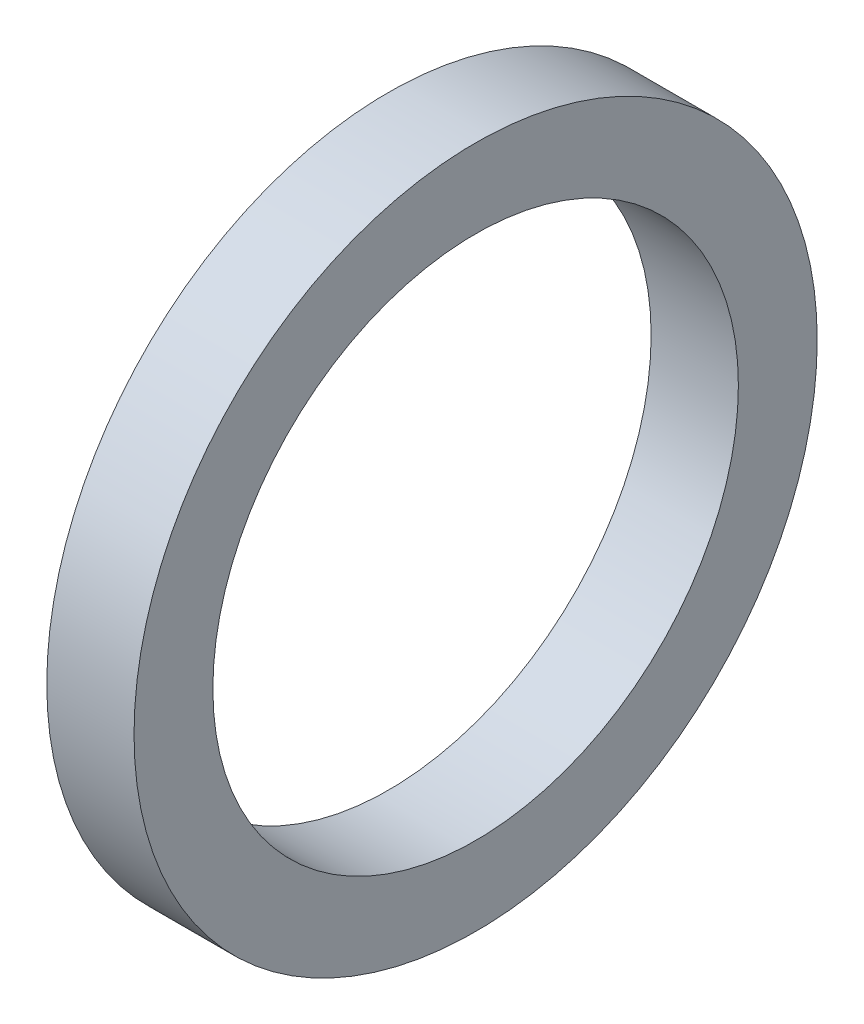
ISO-10303-21;
HEADER;
FILE_DESCRIPTION(('STEP AP214'),'2;1');
FILE_NAME('part.step','',(''),(''),'','','');
FILE_SCHEMA(('AUTOMOTIVE_DESIGN { 1 0 10303 214 1 1 1 1 }'));
ENDSEC;
DATA;
#1=APPLICATION_CONTEXT('core data for automotive mechanical design processes');
#2=APPLICATION_PROTOCOL_DEFINITION('international standard','automotive_design',2000,#1);
#3=PRODUCT_CONTEXT('',#1,'mechanical');
#4=PRODUCT('Part','Part','',(#3));
#5=PRODUCT_RELATED_PRODUCT_CATEGORY('part','',(#4));
#6=PRODUCT_DEFINITION_FORMATION('','',#4);
#7=PRODUCT_DEFINITION_CONTEXT('part definition',#1,'design');
#8=PRODUCT_DEFINITION('design','',#6,#7);
#9=PRODUCT_DEFINITION_SHAPE('','',#8);
#10=(LENGTH_UNIT() NAMED_UNIT(*) SI_UNIT(.MILLI.,.METRE.));
#11=(NAMED_UNIT(*) PLANE_ANGLE_UNIT() SI_UNIT($,.RADIAN.));
#12=(NAMED_UNIT(*) SI_UNIT($,.STERADIAN.) SOLID_ANGLE_UNIT());
#13=UNCERTAINTY_MEASURE_WITH_UNIT(LENGTH_MEASURE(1.E-05),#10,'distance_accuracy_value','');
#14=(GEOMETRIC_REPRESENTATION_CONTEXT(3) GLOBAL_UNCERTAINTY_ASSIGNED_CONTEXT((#13)) GLOBAL_UNIT_ASSIGNED_CONTEXT((#10,
#11,#12)) REPRESENTATION_CONTEXT('',''));
#15=CARTESIAN_POINT('',(0.,0.,0.));
#16=DIRECTION('',(0.,0.,1.));
#17=DIRECTION('',(1.,0.,0.));
#18=AXIS2_PLACEMENT_3D('',#15,#16,#17);
#19=CARTESIAN_POINT('',(0.,0.,0.));
#20=DIRECTION('',(-1.,0.,0.));
#21=DIRECTION('',(0.,0.,1.));
#22=AXIS2_PLACEMENT_3D('',#19,#20,#21);
#23=CYLINDRICAL_SURFACE('',#22,29.999999944);
#24=CARTESIAN_POINT('',(-1.81519982400001,0.,0.));
#25=DIRECTION('',(-1.,0.,0.));
#26=DIRECTION('',(0.,0.,1.));
#27=AXIS2_PLACEMENT_3D('',#24,#25,#26);
#28=CIRCLE('',#27,29.999999944);
#29=CARTESIAN_POINT('',(-1.81519982400001,0.,29.999999944));
#30=VERTEX_POINT('',#29);
#31=EDGE_CURVE('E49',#30,#30,#28,.T.);
#32=ORIENTED_EDGE('',*,*,#31,.F.);
#33=EDGE_LOOP('',(#32));
#34=FACE_BOUND('',#33,.T.);
#35=CARTESIAN_POINT('',(-11.775199716,0.,0.));
#36=DIRECTION('',(-1.,0.,0.));
#37=DIRECTION('',(0.,0.,1.));
#38=AXIS2_PLACEMENT_3D('',#35,#36,#37);
#39=CIRCLE('',#38,29.999999944);
#40=CARTESIAN_POINT('',(-11.775199716,0.,29.999999944));
#41=VERTEX_POINT('',#40);
#42=EDGE_CURVE('E10',#41,#41,#39,.T.);
#43=ORIENTED_EDGE('',*,*,#42,.T.);
#44=EDGE_LOOP('',(#43));
#45=FACE_BOUND('',#44,.T.);
#46=ADVANCED_FACE('F35',(#34,#45),#23,.F.);
#47=CARTESIAN_POINT('',(-11.775199716,29.999999944,0.));
#48=DIRECTION('',(1.,0.,0.));
#49=DIRECTION('',(0.,0.,-1.));
#50=AXIS2_PLACEMENT_3D('',#47,#48,#49);
#51=PLANE('',#50);
#52=ORIENTED_EDGE('',*,*,#42,.F.);
#53=EDGE_LOOP('',(#52));
#54=FACE_BOUND('',#53,.T.);
#55=CARTESIAN_POINT('',(-11.775199716,0.,0.));
#56=DIRECTION('',(-1.,0.,0.));
#57=DIRECTION('',(0.,0.,1.));
#58=AXIS2_PLACEMENT_3D('',#55,#56,#57);
#59=CIRCLE('',#58,38.999999978);
#60=CARTESIAN_POINT('',(-11.775199716,0.,38.999999978));
#61=VERTEX_POINT('',#60);
#62=EDGE_CURVE('E41',#61,#61,#59,.T.);
#63=ORIENTED_EDGE('',*,*,#62,.T.);
#64=EDGE_LOOP('',(#63));
#65=FACE_BOUND('',#64,.T.);
#66=ADVANCED_FACE('F58',(#54,#65),#51,.F.);
#67=CARTESIAN_POINT('',(0.,0.,0.));
#68=DIRECTION('',(-1.,0.,0.));
#69=DIRECTION('',(0.,0.,1.));
#70=AXIS2_PLACEMENT_3D('',#67,#68,#69);
#71=CYLINDRICAL_SURFACE('',#70,38.999999978);
#72=ORIENTED_EDGE('',*,*,#62,.F.);
#73=EDGE_LOOP('',(#72));
#74=FACE_BOUND('',#73,.T.);
#75=CARTESIAN_POINT('',(-1.815199824,0.,0.));
#76=DIRECTION('',(-1.,0.,0.));
#77=DIRECTION('',(0.,0.,1.));
#78=AXIS2_PLACEMENT_3D('',#75,#76,#77);
#79=CIRCLE('',#78,38.999999978);
#80=CARTESIAN_POINT('',(-1.815199824,0.,38.999999978));
#81=VERTEX_POINT('',#80);
#82=EDGE_CURVE('E45',#81,#81,#79,.T.);
#83=ORIENTED_EDGE('',*,*,#82,.T.);
#84=EDGE_LOOP('',(#83));
#85=FACE_BOUND('',#84,.T.);
#86=ADVANCED_FACE('F62',(#74,#85),#71,.T.);
#87=CARTESIAN_POINT('',(-1.815199824,29.999999944,0.));
#88=DIRECTION('',(-1.,0.,0.));
#89=DIRECTION('',(0.,0.,1.));
#90=AXIS2_PLACEMENT_3D('',#87,#88,#89);
#91=PLANE('',#90);
#92=ORIENTED_EDGE('',*,*,#82,.F.);
#93=EDGE_LOOP('',(#92));
#94=FACE_BOUND('',#93,.T.);
#95=ORIENTED_EDGE('',*,*,#31,.T.);
#96=EDGE_LOOP('',(#95));
#97=FACE_BOUND('',#96,.T.);
#98=ADVANCED_FACE('F55',(#94,#97),#91,.F.);
#99=CLOSED_SHELL('',(#46,#66,#86,#98));
#100=MANIFOLD_SOLID_BREP('B2',#99);
#101=ADVANCED_BREP_SHAPE_REPRESENTATION('',(#18,#100),#14);
#102=SHAPE_DEFINITION_REPRESENTATION(#9,#101);
ENDSEC;
END-ISO-10303-21;
